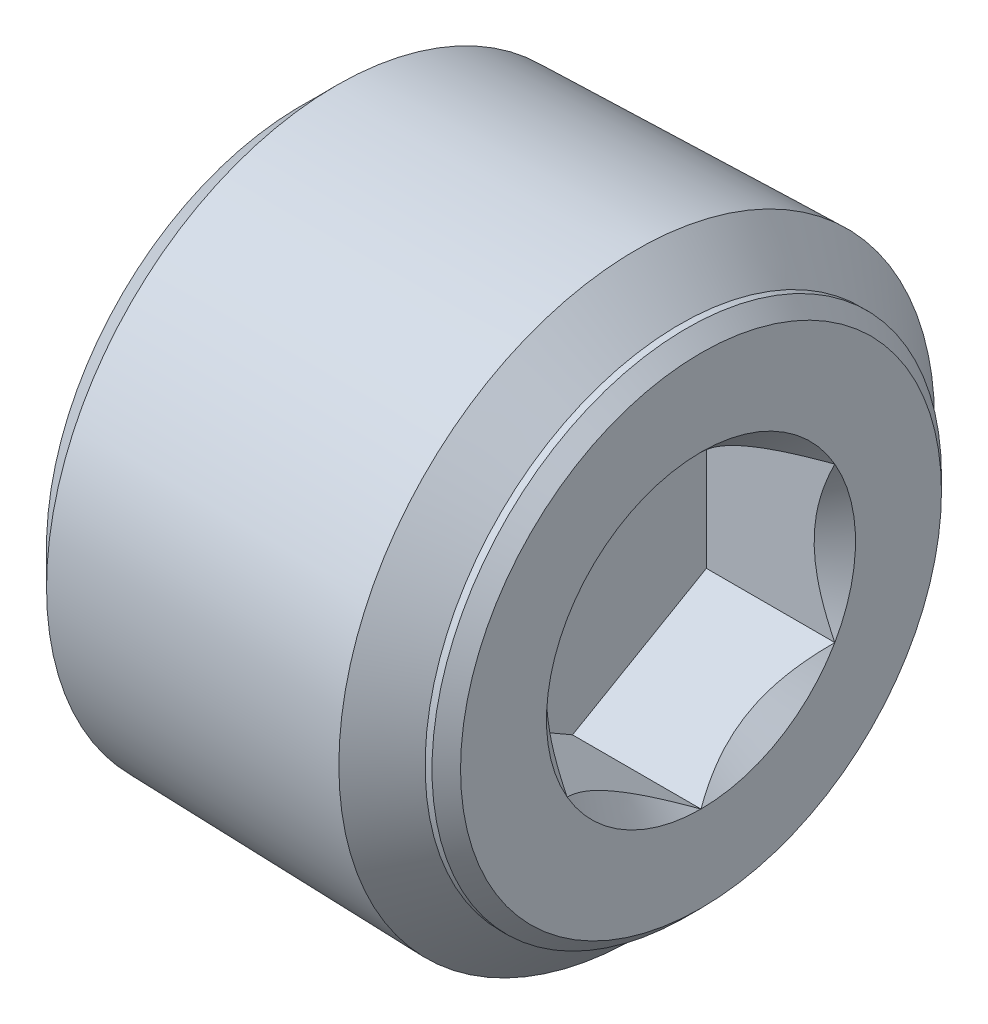
ISO-10303-21;
HEADER;
FILE_DESCRIPTION(('STEP AP214'),'2;1');
FILE_NAME('part.step','',(''),(''),'','','');
FILE_SCHEMA(('AUTOMOTIVE_DESIGN { 1 0 10303 214 1 1 1 1 }'));
ENDSEC;
DATA;
#1=APPLICATION_CONTEXT('core data for automotive mechanical design processes');
#2=APPLICATION_PROTOCOL_DEFINITION('international standard','automotive_design',2000,#1);
#3=PRODUCT_CONTEXT('',#1,'mechanical');
#4=PRODUCT('Part','Part','',(#3));
#5=PRODUCT_RELATED_PRODUCT_CATEGORY('part','',(#4));
#6=PRODUCT_DEFINITION_FORMATION('','',#4);
#7=PRODUCT_DEFINITION_CONTEXT('part definition',#1,'design');
#8=PRODUCT_DEFINITION('design','',#6,#7);
#9=PRODUCT_DEFINITION_SHAPE('','',#8);
#10=(LENGTH_UNIT() NAMED_UNIT(*) SI_UNIT(.MILLI.,.METRE.));
#11=(NAMED_UNIT(*) PLANE_ANGLE_UNIT() SI_UNIT($,.RADIAN.));
#12=(NAMED_UNIT(*) SI_UNIT($,.STERADIAN.) SOLID_ANGLE_UNIT());
#13=UNCERTAINTY_MEASURE_WITH_UNIT(LENGTH_MEASURE(1.E-05),#10,'distance_accuracy_value','');
#14=(GEOMETRIC_REPRESENTATION_CONTEXT(3) GLOBAL_UNCERTAINTY_ASSIGNED_CONTEXT((#13)) GLOBAL_UNIT_ASSIGNED_CONTEXT((#10,
#11,#12)) REPRESENTATION_CONTEXT('',''));
#15=CARTESIAN_POINT('',(0.,0.,0.));
#16=DIRECTION('',(0.,0.,1.));
#17=DIRECTION('',(1.,0.,0.));
#18=AXIS2_PLACEMENT_3D('',#15,#16,#17);
#19=CARTESIAN_POINT('',(-3.556,0.,0.));
#20=DIRECTION('',(1.,0.,0.));
#21=DIRECTION('',(0.,0.,-1.));
#22=AXIS2_PLACEMENT_3D('',#19,#20,#21);
#23=CONICAL_SURFACE('',#22,5.1435,0.026179938779915);
#24=CARTESIAN_POINT('',(-2.92854035608423,0.,0.));
#25=DIRECTION('',(1.,0.,0.));
#26=DIRECTION('',(0.,0.,-1.));
#27=AXIS2_PLACEMENT_3D('',#24,#25,#26);
#28=CIRCLE('',#27,5.15993060902341);
#29=CARTESIAN_POINT('',(-2.92854035608423,0.,-5.15993060902341));
#30=VERTEX_POINT('',#29);
#31=EDGE_CURVE('E360',#30,#30,#28,.T.);
#32=ORIENTED_EDGE('',*,*,#31,.T.);
#33=EDGE_LOOP('',(#32));
#34=FACE_BOUND('',#33,.T.);
#35=CARTESIAN_POINT('',(2.41238695608476,0.,0.));
#36=DIRECTION('',(-1.,0.,0.));
#37=DIRECTION('',(0.,0.,1.));
#38=AXIS2_PLACEMENT_3D('',#35,#36,#37);
#39=CIRCLE('',#38,5.2997877127266);
#40=CARTESIAN_POINT('',(2.41238695608476,0.,5.2997877127266));
#41=VERTEX_POINT('',#40);
#42=EDGE_CURVE('E366',#41,#41,#39,.F.);
#43=ORIENTED_EDGE('',*,*,#42,.F.);
#44=EDGE_LOOP('',(#43));
#45=FACE_BOUND('',#44,.T.);
#46=ADVANCED_FACE('F37',(#34,#45),#23,.T.);
#47=CARTESIAN_POINT('',(-3.556,0.,0.));
#48=DIRECTION('',(1.,0.,0.));
#49=DIRECTION('',(0.,0.,-1.));
#50=AXIS2_PLACEMENT_3D('',#47,#48,#49);
#51=CONICAL_SURFACE('',#50,4.53247096510764,0.78539816339745);
#52=CARTESIAN_POINT('',(-3.556,0.,0.));
#53=DIRECTION('',(1.,0.,0.));
#54=DIRECTION('',(0.,0.,-1.));
#55=AXIS2_PLACEMENT_3D('',#52,#53,#54);
#56=CIRCLE('',#55,4.53247096510764);
#57=CARTESIAN_POINT('',(-3.556,0.,-4.53247096510764));
#58=VERTEX_POINT('',#57);
#59=EDGE_CURVE('E361',#58,#58,#56,.T.);
#60=ORIENTED_EDGE('',*,*,#59,.T.);
#61=EDGE_LOOP('',(#60));
#62=FACE_BOUND('',#61,.T.);
#63=ORIENTED_EDGE('',*,*,#31,.F.);
#64=EDGE_LOOP('',(#63));
#65=FACE_BOUND('',#64,.T.);
#66=ADVANCED_FACE('F201',(#62,#65),#51,.T.);
#67=CARTESIAN_POINT('',(-3.556,0.,0.));
#68=DIRECTION('',(1.,0.,0.));
#69=DIRECTION('',(0.,0.,-1.));
#70=AXIS2_PLACEMENT_3D('',#67,#68,#69);
#71=PLANE('',#70);
#72=ORIENTED_EDGE('',*,*,#59,.F.);
#73=EDGE_LOOP('',(#72));
#74=FACE_BOUND('',#73,.T.);
#75=ADVANCED_FACE('F206',(#74),#71,.F.);
#76=CARTESIAN_POINT('',(3.1797037037037,0.,0.));
#77=DIRECTION('',(-1.,0.,0.));
#78=DIRECTION('',(0.,0.,-1.));
#79=AXIS2_PLACEMENT_3D('',#76,#77,#78);
#80=CONICAL_SURFACE('',#79,4.53247096510764,0.78539816339745);
#81=CARTESIAN_POINT('',(3.1797037037037,0.,0.));
#82=DIRECTION('',(1.,0.,0.));
#83=DIRECTION('',(0.,0.,-1.));
#84=AXIS2_PLACEMENT_3D('',#81,#82,#83);
#85=CIRCLE('',#84,4.53247096510764);
#86=CARTESIAN_POINT('',(3.1797037037037,0.,-4.53247096510764));
#87=VERTEX_POINT('',#86);
#88=EDGE_CURVE('E369',#87,#87,#85,.T.);
#89=ORIENTED_EDGE('',*,*,#88,.F.);
#90=EDGE_LOOP('',(#89));
#91=FACE_BOUND('',#90,.T.);
#92=ORIENTED_EDGE('',*,*,#42,.T.);
#93=EDGE_LOOP('',(#92));
#94=FACE_BOUND('',#93,.T.);
#95=ADVANCED_FACE('F214',(#91,#94),#80,.T.);
#96=CARTESIAN_POINT('',(3.556,0.,0.));
#97=DIRECTION('',(1.,0.,0.));
#98=DIRECTION('',(0.,0.,-1.));
#99=AXIS2_PLACEMENT_3D('',#96,#97,#98);
#100=PLANE('',#99);
#101=CARTESIAN_POINT('',(3.556,0.,0.));
#102=DIRECTION('',(1.,0.,0.));
#103=DIRECTION('',(0.,0.,-1.));
#104=AXIS2_PLACEMENT_3D('',#101,#102,#103);
#105=CIRCLE('',#104,2.74963065701559);
#106=CARTESIAN_POINT('',(3.556,1.37481532850779,-2.38125));
#107=VERTEX_POINT('',#106);
#108=CARTESIAN_POINT('',(3.556,2.74963065701559,0.));
#109=VERTEX_POINT('',#108);
#110=EDGE_CURVE('E91',#107,#109,#105,.T.);
#111=ORIENTED_EDGE('',*,*,#110,.F.);
#112=CARTESIAN_POINT('',(3.556,-1.3748153285078,-2.38125));
#113=VERTEX_POINT('',#112);
#114=EDGE_CURVE('E51',#113,#107,#105,.T.);
#115=ORIENTED_EDGE('',*,*,#114,.F.);
#116=CARTESIAN_POINT('',(3.556,-2.74963065701559,0.));
#117=VERTEX_POINT('',#116);
#118=EDGE_CURVE('E398',#117,#113,#105,.T.);
#119=ORIENTED_EDGE('',*,*,#118,.F.);
#120=CARTESIAN_POINT('',(3.556,-1.3748153285078,2.38125));
#121=VERTEX_POINT('',#120);
#122=EDGE_CURVE('E58',#121,#117,#105,.T.);
#123=ORIENTED_EDGE('',*,*,#122,.F.);
#124=CARTESIAN_POINT('',(3.556,1.3748153285078,2.38125));
#125=VERTEX_POINT('',#124);
#126=EDGE_CURVE('E131',#125,#121,#105,.T.);
#127=ORIENTED_EDGE('',*,*,#126,.F.);
#128=EDGE_CURVE('E100',#109,#125,#105,.T.);
#129=ORIENTED_EDGE('',*,*,#128,.F.);
#130=EDGE_LOOP('',(#111,#115,#119,#123,#127,#129));
#131=FACE_BOUND('',#130,.T.);
#132=CARTESIAN_POINT('',(3.556,0.,0.));
#133=DIRECTION('',(1.,0.,0.));
#134=DIRECTION('',(0.,0.,-1.));
#135=AXIS2_PLACEMENT_3D('',#132,#133,#134);
#136=CIRCLE('',#135,4.27847096510764);
#137=CARTESIAN_POINT('',(3.556,0.,-4.27847096510764));
#138=VERTEX_POINT('',#137);
#139=EDGE_CURVE('E45',#138,#138,#136,.T.);
#140=ORIENTED_EDGE('',*,*,#139,.T.);
#141=EDGE_LOOP('',(#140));
#142=FACE_BOUND('',#141,.T.);
#143=ADVANCED_FACE('F129',(#131,#142),#100,.T.);
#144=CARTESIAN_POINT('',(3.1797037037037,0.,0.));
#145=DIRECTION('',(1.,0.,0.));
#146=DIRECTION('',(0.,0.,-1.));
#147=AXIS2_PLACEMENT_3D('',#144,#145,#146);
#148=CYLINDRICAL_SURFACE('',#147,4.53247096510764);
#149=CARTESIAN_POINT('',(3.302,0.,0.));
#150=DIRECTION('',(1.,0.,0.));
#151=DIRECTION('',(0.,0.,-1.));
#152=AXIS2_PLACEMENT_3D('',#149,#150,#151);
#153=CIRCLE('',#152,4.53247096510764);
#154=CARTESIAN_POINT('',(3.302,0.,-4.53247096510764));
#155=VERTEX_POINT('',#154);
#156=EDGE_CURVE('E12',#155,#155,#153,.F.);
#157=ORIENTED_EDGE('',*,*,#156,.T.);
#158=EDGE_LOOP('',(#157));
#159=FACE_BOUND('',#158,.T.);
#160=ORIENTED_EDGE('',*,*,#88,.T.);
#161=EDGE_LOOP('',(#160));
#162=FACE_BOUND('',#161,.T.);
#163=ADVANCED_FACE('F217',(#159,#162),#148,.T.);
#164=CARTESIAN_POINT('',(3.556,0.,0.));
#165=DIRECTION('',(-1.,0.,0.));
#166=DIRECTION('',(0.,0.,1.));
#167=AXIS2_PLACEMENT_3D('',#164,#165,#166);
#168=CONICAL_SURFACE('',#167,4.27847096510764,0.785398163397448);
#169=ORIENTED_EDGE('',*,*,#156,.F.);
#170=EDGE_LOOP('',(#169));
#171=FACE_BOUND('',#170,.T.);
#172=ORIENTED_EDGE('',*,*,#139,.F.);
#173=EDGE_LOOP('',(#172));
#174=FACE_BOUND('',#173,.T.);
#175=ADVANCED_FACE('F39',(#171,#174),#168,.T.);
#176=CARTESIAN_POINT('',(3.556,0.,0.));
#177=DIRECTION('',(1.,0.,0.));
#178=DIRECTION('',(0.,0.,-1.));
#179=AXIS2_PLACEMENT_3D('',#176,#177,#178);
#180=CONICAL_SURFACE('',#179,2.74963065701559,0.78539816339745);
#181=ORIENTED_EDGE('',*,*,#128,.T.);
#182=CARTESIAN_POINT('',(3.55611547732724,2.74974612706943,-0.000199999999999625));
#183=CARTESIAN_POINT('',(3.50889489670954,2.70248609172789,0.0816567823790504));
#184=CARTESIAN_POINT('',(3.4644475752929,2.65443579722785,0.16488233377176));
#185=CARTESIAN_POINT('',(3.38306545698558,2.556455907536,0.33458848083804));
#186=CARTESIAN_POINT('',(3.34617594309514,2.50651699342501,0.421085217353102));
#187=CARTESIAN_POINT('',(3.28298341316591,2.40581754748857,0.595501774009041));
#188=CARTESIAN_POINT('',(3.25652155872948,2.35508266327639,0.683377171180673));
#189=CARTESIAN_POINT('',(3.21575151561606,2.25249593653966,0.861062594070874));
#190=CARTESIAN_POINT('',(3.20141289153055,2.20064722822085,0.950867191185869));
#191=CARTESIAN_POINT('',(3.18847578477012,2.11128933452158,1.10563960313034));
#192=CARTESIAN_POINT('',(3.18656060465318,2.07389560129144,1.17040744896962));
#193=CARTESIAN_POINT('',(3.18978662276768,1.99916925388849,1.29983727933557));
#194=CARTESIAN_POINT('',(3.19493029485709,1.96183666573622,1.36449921879335));
#195=CARTESIAN_POINT('',(3.21198131087164,1.88752399013711,1.49321254857739));
#196=CARTESIAN_POINT('',(3.22389622134933,1.85054434417201,1.55726317423485));
#197=CARTESIAN_POINT('',(3.25383567235203,1.77722451768917,1.68425683890527));
#198=CARTESIAN_POINT('',(3.27185974451845,1.74088428837517,1.74719996243582));
#199=CARTESIAN_POINT('',(3.32536880755241,1.64780030516185,1.90842615073218));
#200=CARTESIAN_POINT('',(3.36488742087218,1.59163374230437,2.00570949128784));
#201=CARTESIAN_POINT('',(3.4316003435508,1.50904576583588,2.14875606262557));
#202=CARTESIAN_POINT('',(3.45504020911133,1.4818293434813,2.19589628894396));
#203=CARTESIAN_POINT('',(3.50405667665954,1.42790064981105,2.28930352636664));
#204=CARTESIAN_POINT('',(3.52963196676686,1.40118808114506,2.33557105249682));
#205=CARTESIAN_POINT('',(3.55611547732724,1.37469985845396,2.38145));
#206=B_SPLINE_CURVE_WITH_KNOTS('',3,(#182,#183,#184,#185,#186,#187,#188,#189,#190,#191,#192,
#193,#194,#195,#196,#197,#198,#199,#200,#201,#202,#203,#204,#205),.UNSPECIFIED.,.F.,.F.,(4,2,2,
2,2,2,2,2,2,2,2,4),(0.,0.317196610611948,0.636241461041217,0.950218950629219,1.26340583824126,
1.48752413747844,1.71172100167747,1.93616888974081,2.16059957440836,2.51709639744763,
2.69486147369099,2.87251813383154),.UNSPECIFIED.);
#207=EDGE_CURVE('E99',#109,#125,#206,.T.);
#208=ORIENTED_EDGE('',*,*,#207,.F.);
#209=EDGE_LOOP('',(#181,#208));
#210=FACE_BOUND('',#209,.T.);
#211=ADVANCED_FACE('F105',(#210),#180,.F.);
#212=ORIENTED_EDGE('',*,*,#126,.T.);
#213=CARTESIAN_POINT('',(4.47271541112649,-2.78778441219563,2.38125));
#214=CARTESIAN_POINT('',(4.42126754971886,-2.72010759216642,2.38125));
#215=CARTESIAN_POINT('',(4.37030342909743,-2.65205702767121,2.38125));
#216=CARTESIAN_POINT('',(4.26956087821853,-2.51505902131785,2.38125));
#217=CARTESIAN_POINT('',(4.21978274233974,-2.44611136322079,2.38125));
#218=CARTESIAN_POINT('',(4.12127616598597,-2.30666538697512,2.38125));
#219=CARTESIAN_POINT('',(4.07255883072452,-2.23615919760946,2.38125));
#220=CARTESIAN_POINT('',(3.97689665657255,-2.09395822931675,2.38125));
#221=CARTESIAN_POINT('',(3.92995169369347,-2.02226353403998,2.38125));
#222=CARTESIAN_POINT('',(3.83550082426837,-1.87318157487134,2.38125));
#223=CARTESIAN_POINT('',(3.78812799969588,-1.79570956798511,2.38125));
#224=CARTESIAN_POINT('',(3.69644738214397,-1.63897526960824,2.38125));
#225=CARTESIAN_POINT('',(3.65213918658097,-1.55971321508796,2.38125));
#226=CARTESIAN_POINT('',(3.5675177629337,-1.39936201208901,2.38125));
#227=CARTESIAN_POINT('',(3.52719333714926,-1.31827881955674,2.38125));
#228=CARTESIAN_POINT('',(3.45144985771474,-1.15387104478002,2.38125));
#229=CARTESIAN_POINT('',(3.41602854857673,-1.07054751432376,2.38125));
#230=CARTESIAN_POINT('',(3.35418387969588,-0.90889089954783,2.38125));
#231=CARTESIAN_POINT('',(3.3272449811477,-0.830757093392354,2.38125));
#232=CARTESIAN_POINT('',(3.279629606023,-0.672568271802735,2.38125));
#233=CARTESIAN_POINT('',(3.2589535483539,-0.592513128240977,2.38125));
#234=CARTESIAN_POINT('',(3.22530169560673,-0.432313535258421,2.38125));
#235=CARTESIAN_POINT('',(3.21219112751661,-0.352197871157622,2.38125));
#236=CARTESIAN_POINT('',(3.19393204032071,-0.191059474930294,2.38125));
#237=CARTESIAN_POINT('',(3.18878205458479,-0.110036912658787,2.38125));
#238=CARTESIAN_POINT('',(3.18684721288921,0.0489619568367768,2.38125));
#239=CARTESIAN_POINT('',(3.18974556433605,0.126934492876664,2.38125));
#240=CARTESIAN_POINT('',(3.20303752714723,0.282233283697431,2.38125));
#241=CARTESIAN_POINT('',(3.21343185051391,0.359559476379757,2.38125));
#242=CARTESIAN_POINT('',(3.24131715305985,0.514316775735605,2.38125));
#243=CARTESIAN_POINT('',(3.25893052155444,0.591725500190306,2.38125));
#244=CARTESIAN_POINT('',(3.30030391638431,0.744842484650164,2.38125));
#245=CARTESIAN_POINT('',(3.32406348691027,0.82055087030206,2.38125));
#246=CARTESIAN_POINT('',(3.40721811924092,1.05687746293571,2.38125));
#247=CARTESIAN_POINT('',(3.47599823645053,1.21420525817212,2.38125));
#248=CARTESIAN_POINT('',(3.5906725469918,1.4444429103218,2.38125));
#249=CARTESIAN_POINT('',(3.63090460604891,1.52037247424081,2.38125));
#250=CARTESIAN_POINT('',(3.71447132596669,1.67050883715942,2.38125));
#251=CARTESIAN_POINT('',(3.75780543303833,1.74471594054207,2.38125));
#252=CARTESIAN_POINT('',(3.84474016068554,1.88796752692232,2.38125));
#253=CARTESIAN_POINT('',(3.88822099819505,1.95708553613458,2.38125));
#254=CARTESIAN_POINT('',(3.97702142273679,2.09413609519946,2.38125));
#255=CARTESIAN_POINT('',(4.02234114851942,2.1620685550432,2.38125));
#256=CARTESIAN_POINT('',(4.11411756879495,2.29635234061959,2.38125));
#257=CARTESIAN_POINT('',(4.1605621059153,2.36271200992475,2.38125));
#258=CARTESIAN_POINT('',(4.25468628731882,2.49452301460492,2.38125));
#259=CARTESIAN_POINT('',(4.3023655880396,2.55997459502686,2.38125));
#260=CARTESIAN_POINT('',(4.35055009427172,2.62504583489422,2.38125));
#261=B_SPLINE_CURVE_WITH_KNOTS('',3,(#213,#214,#215,#216,#217,#218,#219,#220,#221,#222,#223,
#224,#225,#226,#227,#228,#229,#230,#231,#232,#233,#234,#235,#236,#237,#238,#239,#240,#241,#242,
#243,#244,#245,#246,#247,#248,#249,#250,#251,#252,#253,#254,#255,#256,#257,#258,#259,#260),
.UNSPECIFIED.,.F.,.F.,(4,2,2,2,2,2,2,2,2,2,2,2,2,2,2,2,2,2,2,2,2,2,2,4),(0.,0.255040809094692,
0.510144277062726,0.76722203318704,1.02428177166123,1.2966499195995,1.56898221979864,
1.84052585446871,2.11194415796923,2.35967016199274,2.60741273219744,2.85059368779453,
3.09372983523197,3.3274329547983,3.56115827550052,3.79902174822543,4.03686758578061,
4.55038530526843,4.80815341388469,5.06587561900448,5.31081733436981,5.55577756591949,
5.79875695917182,6.04166945685491),.UNSPECIFIED.);
#262=EDGE_CURVE('E109',#125,#121,#261,.F.);
#263=ORIENTED_EDGE('',*,*,#262,.F.);
#264=EDGE_LOOP('',(#212,#263));
#265=FACE_BOUND('',#264,.T.);
#266=ADVANCED_FACE('F291',(#265),#180,.F.);
#267=ORIENTED_EDGE('',*,*,#122,.T.);
#268=CARTESIAN_POINT('',(3.55611547732724,-1.37469985845396,2.38145));
#269=CARTESIAN_POINT('',(3.50889489670954,-1.4219598937955,2.29959321762095));
#270=CARTESIAN_POINT('',(3.4644475752929,-1.47001018829554,2.21636766622824));
#271=CARTESIAN_POINT('',(3.38306545698558,-1.56799007798739,2.04666151916196));
#272=CARTESIAN_POINT('',(3.34617594309514,-1.61792899209838,1.9601647826469));
#273=CARTESIAN_POINT('',(3.28298341316591,-1.71862843803482,1.78574822599096));
#274=CARTESIAN_POINT('',(3.25652155872948,-1.769363322247,1.69787282881933));
#275=CARTESIAN_POINT('',(3.21575151561606,-1.87195004898373,1.52018740592913));
#276=CARTESIAN_POINT('',(3.20141289153055,-1.92379875730254,1.43038280881413));
#277=CARTESIAN_POINT('',(3.18847578477012,-2.01315665100181,1.27561039686966));
#278=CARTESIAN_POINT('',(3.18656060465318,-2.05055038423195,1.21084255103038));
#279=CARTESIAN_POINT('',(3.18978662276768,-2.1252767316349,1.08141272066443));
#280=CARTESIAN_POINT('',(3.19493029485709,-2.16260931978717,1.01675078120665));
#281=CARTESIAN_POINT('',(3.21198131087164,-2.23692199538628,0.888037451422605));
#282=CARTESIAN_POINT('',(3.22389622134933,-2.27390164135138,0.823986825765148));
#283=CARTESIAN_POINT('',(3.25383567235203,-2.34722146783422,0.696993161094729));
#284=CARTESIAN_POINT('',(3.27185974451845,-2.38356169714822,0.634050037564178));
#285=CARTESIAN_POINT('',(3.32536880755241,-2.47664568036154,0.47282384926782));
#286=CARTESIAN_POINT('',(3.36488742087218,-2.53281224321902,0.375540508712161));
#287=CARTESIAN_POINT('',(3.4316003435508,-2.61540021968751,0.232493937374431));
#288=CARTESIAN_POINT('',(3.45504020911134,-2.64261664204209,0.185353711056036));
#289=CARTESIAN_POINT('',(3.50405667665954,-2.69654533571233,0.0919464736333625));
#290=CARTESIAN_POINT('',(3.52963196676686,-2.72325790437833,0.0456789475031791));
#291=CARTESIAN_POINT('',(3.55611547732724,-2.74974612706943,-0.000199999999999681));
#292=B_SPLINE_CURVE_WITH_KNOTS('',3,(#268,#269,#270,#271,#272,#273,#274,#275,#276,#277,#278,
#279,#280,#281,#282,#283,#284,#285,#286,#287,#288,#289,#290,#291),.UNSPECIFIED.,.F.,.F.,(4,2,2,
2,2,2,2,2,2,2,2,4),(0.,0.317196610611948,0.636241461041218,0.950218950629221,1.26340583824126,
1.48752413747844,1.71172100167747,1.93616888974082,2.16059957440836,2.51709639744763,
2.69486147369099,2.87251813383154),.UNSPECIFIED.);
#293=EDGE_CURVE('E158',#121,#117,#292,.T.);
#294=ORIENTED_EDGE('',*,*,#293,.F.);
#295=EDGE_LOOP('',(#267,#294));
#296=FACE_BOUND('',#295,.T.);
#297=ADVANCED_FACE('F282',(#296),#180,.F.);
#298=ORIENTED_EDGE('',*,*,#118,.T.);
#299=CARTESIAN_POINT('',(3.55611547732724,-2.74974612706943,0.000200000000000406));
#300=CARTESIAN_POINT('',(3.50889489670954,-2.70248609172789,-0.0816567823790498));
#301=CARTESIAN_POINT('',(3.4644475752929,-2.65443579722785,-0.16488233377176));
#302=CARTESIAN_POINT('',(3.38306545698558,-2.556455907536,-0.334588480838039));
#303=CARTESIAN_POINT('',(3.34617594309514,-2.50651699342501,-0.421085217353102));
#304=CARTESIAN_POINT('',(3.28298341316591,-2.40581754748857,-0.595501774009041));
#305=CARTESIAN_POINT('',(3.25652155872948,-2.35508266327639,-0.683377171180674));
#306=CARTESIAN_POINT('',(3.21575151561606,-2.25249593653966,-0.861062594070874));
#307=CARTESIAN_POINT('',(3.20141289153055,-2.20064722822085,-0.950867191185869));
#308=CARTESIAN_POINT('',(3.18847578477012,-2.11128933452158,-1.10563960313034));
#309=CARTESIAN_POINT('',(3.18656060465318,-2.07389560129144,-1.17040744896962));
#310=CARTESIAN_POINT('',(3.18978662276768,-1.99916925388849,-1.29983727933557));
#311=CARTESIAN_POINT('',(3.19493029485709,-1.96183666573622,-1.36449921879335));
#312=CARTESIAN_POINT('',(3.21198131087164,-1.88752399013711,-1.49321254857739));
#313=CARTESIAN_POINT('',(3.22389622134933,-1.85054434417201,-1.55726317423485));
#314=CARTESIAN_POINT('',(3.25383567235203,-1.77722451768917,-1.68425683890527));
#315=CARTESIAN_POINT('',(3.27185974451845,-1.74088428837517,-1.74719996243582));
#316=CARTESIAN_POINT('',(3.32536880755241,-1.64780030516185,-1.90842615073218));
#317=CARTESIAN_POINT('',(3.36488742087218,-1.59163374230437,-2.00570949128784));
#318=CARTESIAN_POINT('',(3.4316003435508,-1.50904576583588,-2.14875606262557));
#319=CARTESIAN_POINT('',(3.45504020911134,-1.4818293434813,-2.19589628894396));
#320=CARTESIAN_POINT('',(3.50405667665954,-1.42790064981106,-2.28930352636664));
#321=CARTESIAN_POINT('',(3.52963196676686,-1.40118808114506,-2.33557105249682));
#322=CARTESIAN_POINT('',(3.55611547732724,-1.37469985845396,-2.38145));
#323=B_SPLINE_CURVE_WITH_KNOTS('',3,(#299,#300,#301,#302,#303,#304,#305,#306,#307,#308,#309,
#310,#311,#312,#313,#314,#315,#316,#317,#318,#319,#320,#321,#322),.UNSPECIFIED.,.F.,.F.,(4,2,2,
2,2,2,2,2,2,2,2,4),(0.,0.317196610611949,0.636241461041218,0.950218950629221,1.26340583824126,
1.48752413747844,1.71172100167747,1.93616888974082,2.16059957440836,2.51709639744763,
2.69486147369099,2.87251813383154),.UNSPECIFIED.);
#324=EDGE_CURVE('E165',#117,#113,#323,.T.);
#325=ORIENTED_EDGE('',*,*,#324,.F.);
#326=EDGE_LOOP('',(#298,#325));
#327=FACE_BOUND('',#326,.T.);
#328=ADVANCED_FACE('F274',(#327),#180,.F.);
#329=ORIENTED_EDGE('',*,*,#114,.T.);
#330=CARTESIAN_POINT('',(4.47271541120113,-2.78778441229379,-2.38125));
#331=CARTESIAN_POINT('',(4.42126754979062,-2.72010759226179,-2.38125));
#332=CARTESIAN_POINT('',(4.37030342916631,-2.65205702776379,-2.38125));
#333=CARTESIAN_POINT('',(4.26956087828168,-2.51505902140481,-2.38125));
#334=CARTESIAN_POINT('',(4.21978274240002,-2.44611136330494,-2.38125));
#335=CARTESIAN_POINT('',(4.12127616604052,-2.30666538705353,-2.38125));
#336=CARTESIAN_POINT('',(4.07255883077619,-2.23615919768495,-2.38125));
#337=CARTESIAN_POINT('',(3.97689665661851,-2.09395822938637,-2.38125));
#338=CARTESIAN_POINT('',(3.92995169373659,-2.02226353410663,-2.38125));
#339=CARTESIAN_POINT('',(3.83550082430559,-1.87318157493159,-2.38125));
#340=CARTESIAN_POINT('',(3.78812799973004,-1.79570956804191,-2.38125));
#341=CARTESIAN_POINT('',(3.69644738217216,-1.63897526965803,-2.38125));
#342=CARTESIAN_POINT('',(3.65213918660625,-1.55971321513419,-2.38125));
#343=CARTESIAN_POINT('',(3.56751776295339,-1.39936201212798,-2.38125));
#344=CARTESIAN_POINT('',(3.52719333716627,-1.31827881959202,-2.38125));
#345=CARTESIAN_POINT('',(3.45144985772674,-1.15387104480771,-2.38125));
#346=CARTESIAN_POINT('',(3.41602854858639,-1.07054751434756,-2.38125));
#347=CARTESIAN_POINT('',(3.35418387970384,-0.908890899569974,-2.38125));
#348=CARTESIAN_POINT('',(3.32724498115587,-0.830757093416901,-2.38125));
#349=CARTESIAN_POINT('',(3.27962960603108,-0.672568271832171,-2.38125));
#350=CARTESIAN_POINT('',(3.2589535483617,-0.5925131282729,-2.38125));
#351=CARTESIAN_POINT('',(3.2253016956134,-0.432313535295238,-2.38125));
#352=CARTESIAN_POINT('',(3.21219112752244,-0.352197871196845,-2.38125));
#353=CARTESIAN_POINT('',(3.19393204032431,-0.191059474974255,-2.38125));
#354=CARTESIAN_POINT('',(3.18878205458701,-0.110036912705079,-2.38125));
#355=CARTESIAN_POINT('',(3.18684721288824,0.0489619567863076,-2.38125));
#356=CARTESIAN_POINT('',(3.18974556433332,0.126934492824343,-2.38125));
#357=CARTESIAN_POINT('',(3.2030375271407,0.282233283641599,-2.38125));
#358=CARTESIAN_POINT('',(3.21343185050536,0.359559476322267,-2.38125));
#359=CARTESIAN_POINT('',(3.24131715304706,0.514316775674839,-2.38125));
#360=CARTESIAN_POINT('',(3.25893052153942,0.59172550012793,-2.38125));
#361=CARTESIAN_POINT('',(3.30030391636479,0.744842484584727,-2.38125));
#362=CARTESIAN_POINT('',(3.32406348688849,0.820550870235173,-2.38125));
#363=CARTESIAN_POINT('',(3.40721811920851,1.0568774628544,-2.38125));
#364=CARTESIAN_POINT('',(3.47599823640836,1.21420525807854,-2.38125));
#365=CARTESIAN_POINT('',(3.59067254693419,1.44444291021056,-2.38125));
#366=CARTESIAN_POINT('',(3.630904605986,1.52037247412379,-2.38125));
#367=CARTESIAN_POINT('',(3.714471325893,1.67050883703103,-2.38125));
#368=CARTESIAN_POINT('',(3.75780543295918,1.74471594040809,-2.38125));
#369=CARTESIAN_POINT('',(3.84474016059601,1.88796752677817,-2.38125));
#370=CARTESIAN_POINT('',(3.88822099810063,1.95708553598584,-2.38125));
#371=CARTESIAN_POINT('',(3.97702142263256,2.09413609504161,-2.38125));
#372=CARTESIAN_POINT('',(4.02234114841028,2.16206855488083,-2.38125));
#373=CARTESIAN_POINT('',(4.11411756867605,2.29635234044828,-2.38125));
#374=CARTESIAN_POINT('',(4.16056210579154,2.36271200974903,-2.38125));
#375=CARTESIAN_POINT('',(4.25468628718536,2.49452301442041,-2.38125));
#376=CARTESIAN_POINT('',(4.30236558790129,2.55997459483796,-2.38125));
#377=CARTESIAN_POINT('',(4.35055009412857,2.62504583470095,-2.38125));
#378=B_SPLINE_CURVE_WITH_KNOTS('',3,(#330,#331,#332,#333,#334,#335,#336,#337,#338,#339,#340,
#341,#342,#343,#344,#345,#346,#347,#348,#349,#350,#351,#352,#353,#354,#355,#356,#357,#358,#359,
#360,#361,#362,#363,#364,#365,#366,#367,#368,#369,#370,#371,#372,#373,#374,#375,#376,#377),
.UNSPECIFIED.,.F.,.F.,(4,2,2,2,2,2,2,2,2,2,2,2,2,2,2,2,2,2,2,2,2,2,2,4),(0.,0.255040809106571,
0.510144277086485,0.767222033222905,1.0242817717092,1.29664991966106,1.56898221987379,
1.84052585455735,2.11194415807133,2.35967016208786,2.60741273228559,2.85059368787599,
3.09372983530676,3.32743295486736,3.56115827556386,3.79902174828258,4.03686758583157,
4.55038530527416,4.80815341386764,5.06587561896467,5.31081733431054,5.55577756584076,
5.79875695907389,6.04166945673778),.UNSPECIFIED.);
#379=EDGE_CURVE('E119',#113,#107,#378,.T.);
#380=ORIENTED_EDGE('',*,*,#379,.F.);
#381=EDGE_LOOP('',(#329,#380));
#382=FACE_BOUND('',#381,.T.);
#383=ADVANCED_FACE('F151',(#382),#180,.F.);
#384=ORIENTED_EDGE('',*,*,#110,.T.);
#385=CARTESIAN_POINT('',(3.55611547732724,1.37469985845396,-2.38145));
#386=CARTESIAN_POINT('',(3.50889489670954,1.4219598937955,-2.29959321762095));
#387=CARTESIAN_POINT('',(3.4644475752929,1.47001018829554,-2.21636766622824));
#388=CARTESIAN_POINT('',(3.38306545698558,1.56799007798739,-2.04666151916196));
#389=CARTESIAN_POINT('',(3.34617594309514,1.61792899209838,-1.9601647826469));
#390=CARTESIAN_POINT('',(3.28298341316591,1.71862843803482,-1.78574822599096));
#391=CARTESIAN_POINT('',(3.25652155872948,1.769363322247,-1.69787282881933));
#392=CARTESIAN_POINT('',(3.21575151561606,1.87195004898373,-1.52018740592913));
#393=CARTESIAN_POINT('',(3.20141289153055,1.92379875730254,-1.43038280881413));
#394=CARTESIAN_POINT('',(3.18847578477011,2.01315665100181,-1.27561039686966));
#395=CARTESIAN_POINT('',(3.18656060465318,2.05055038423195,-1.21084255103038));
#396=CARTESIAN_POINT('',(3.18978662276768,2.1252767316349,-1.08141272066443));
#397=CARTESIAN_POINT('',(3.19493029485709,2.16260931978717,-1.01675078120665));
#398=CARTESIAN_POINT('',(3.21198131087164,2.23692199538628,-0.888037451422605));
#399=CARTESIAN_POINT('',(3.22389622134933,2.27390164135138,-0.823986825765148));
#400=CARTESIAN_POINT('',(3.25383567235203,2.34722146783422,-0.696993161094729));
#401=CARTESIAN_POINT('',(3.27185974451845,2.38356169714822,-0.634050037564178));
#402=CARTESIAN_POINT('',(3.32536880755241,2.47664568036154,-0.47282384926782));
#403=CARTESIAN_POINT('',(3.36488742087218,2.53281224321902,-0.375540508712161));
#404=CARTESIAN_POINT('',(3.4316003435508,2.61540021968751,-0.23249393737443));
#405=CARTESIAN_POINT('',(3.45504020911133,2.64261664204209,-0.185353711056036));
#406=CARTESIAN_POINT('',(3.50405667665954,2.69654533571233,-0.0919464736333616));
#407=CARTESIAN_POINT('',(3.52963196676686,2.72325790437833,-0.0456789475031781));
#408=CARTESIAN_POINT('',(3.55611547732724,2.74974612706943,0.000200000000000952));
#409=B_SPLINE_CURVE_WITH_KNOTS('',3,(#385,#386,#387,#388,#389,#390,#391,#392,#393,#394,#395,
#396,#397,#398,#399,#400,#401,#402,#403,#404,#405,#406,#407,#408),.UNSPECIFIED.,.F.,.F.,(4,2,2,
2,2,2,2,2,2,2,2,4),(0.,0.317196610611948,0.636241461041218,0.950218950629221,1.26340583824126,
1.48752413747844,1.71172100167747,1.93616888974082,2.16059957440836,2.51709639744763,
2.69486147369099,2.87251813383154),.UNSPECIFIED.);
#410=EDGE_CURVE('E95',#107,#109,#409,.T.);
#411=ORIENTED_EDGE('',*,*,#410,.F.);
#412=EDGE_LOOP('',(#384,#411));
#413=FACE_BOUND('',#412,.T.);
#414=ADVANCED_FACE('F93',(#413),#180,.F.);
#415=CARTESIAN_POINT('',(1.27,4.12444598552339,2.38125));
#416=DIRECTION('',(1.,0.,0.));
#417=DIRECTION('',(0.,0.,-1.));
#418=AXIS2_PLACEMENT_3D('',#415,#416,#417);
#419=PLANE('',#418);
#420=DIRECTION('',(0.,0.5,0.866025403784439));
#421=VECTOR('',#420,1.);
#422=CARTESIAN_POINT('',(1.27,1.3748153285078,-2.38125));
#423=LINE('',#422,#421);
#424=CARTESIAN_POINT('',(1.27,1.3748153285078,-2.38125));
#425=VERTEX_POINT('',#424);
#426=CARTESIAN_POINT('',(1.27,2.74963065701559,0.));
#427=VERTEX_POINT('',#426);
#428=EDGE_CURVE('E118',#425,#427,#423,.T.);
#429=ORIENTED_EDGE('',*,*,#428,.T.);
#430=DIRECTION('',(0.,-0.5,0.866025403784439));
#431=VECTOR('',#430,1.);
#432=CARTESIAN_POINT('',(1.27,2.74963065701559,0.));
#433=LINE('',#432,#431);
#434=CARTESIAN_POINT('',(1.27,1.3748153285078,2.38125));
#435=VERTEX_POINT('',#434);
#436=EDGE_CURVE('E123',#427,#435,#433,.T.);
#437=ORIENTED_EDGE('',*,*,#436,.T.);
#438=DIRECTION('',(0.,-1.,0.));
#439=VECTOR('',#438,1.);
#440=CARTESIAN_POINT('',(1.27,1.3748153285078,2.38125));
#441=LINE('',#440,#439);
#442=CARTESIAN_POINT('',(1.27,-1.3748153285078,2.38125));
#443=VERTEX_POINT('',#442);
#444=EDGE_CURVE('E390',#435,#443,#441,.T.);
#445=ORIENTED_EDGE('',*,*,#444,.T.);
#446=DIRECTION('',(0.,-0.5,-0.866025403784439));
#447=VECTOR('',#446,1.);
#448=CARTESIAN_POINT('',(1.27,-1.3748153285078,2.38125));
#449=LINE('',#448,#447);
#450=CARTESIAN_POINT('',(1.27,-2.74963065701559,0.));
#451=VERTEX_POINT('',#450);
#452=EDGE_CURVE('E387',#443,#451,#449,.T.);
#453=ORIENTED_EDGE('',*,*,#452,.T.);
#454=DIRECTION('',(0.,0.5,-0.866025403784439));
#455=VECTOR('',#454,1.);
#456=CARTESIAN_POINT('',(1.27,-2.74963065701559,0.));
#457=LINE('',#456,#455);
#458=CARTESIAN_POINT('',(1.27,-1.3748153285078,-2.38125));
#459=VERTEX_POINT('',#458);
#460=EDGE_CURVE('E384',#451,#459,#457,.T.);
#461=ORIENTED_EDGE('',*,*,#460,.T.);
#462=DIRECTION('',(0.,1.,0.));
#463=VECTOR('',#462,1.);
#464=CARTESIAN_POINT('',(1.27,-1.3748153285078,-2.38125));
#465=LINE('',#464,#463);
#466=EDGE_CURVE('E126',#459,#425,#465,.T.);
#467=ORIENTED_EDGE('',*,*,#466,.T.);
#468=EDGE_LOOP('',(#429,#437,#445,#453,#461,#467));
#469=FACE_BOUND('',#468,.T.);
#470=ADVANCED_FACE('F150',(#469),#419,.T.);
#471=CARTESIAN_POINT('',(1.27,2.74963065701559,0.));
#472=DIRECTION('',(0.,0.866025403784439,0.5));
#473=DIRECTION('',(0.,-0.5,0.866025403784439));
#474=AXIS2_PLACEMENT_3D('',#471,#472,#473);
#475=PLANE('',#474);
#476=DIRECTION('',(1.,0.,0.));
#477=VECTOR('',#476,1.);
#478=CARTESIAN_POINT('',(1.27,2.74963065701559,0.));
#479=LINE('',#478,#477);
#480=EDGE_CURVE('E115',#427,#109,#479,.T.);
#481=ORIENTED_EDGE('',*,*,#480,.T.);
#482=ORIENTED_EDGE('',*,*,#207,.T.);
#483=DIRECTION('',(1.,0.,0.));
#484=VECTOR('',#483,1.);
#485=CARTESIAN_POINT('',(1.27,1.3748153285078,2.38125));
#486=LINE('',#485,#484);
#487=EDGE_CURVE('E125',#435,#125,#486,.T.);
#488=ORIENTED_EDGE('',*,*,#487,.F.);
#489=ORIENTED_EDGE('',*,*,#436,.F.);
#490=EDGE_LOOP('',(#481,#482,#488,#489));
#491=FACE_BOUND('',#490,.T.);
#492=ADVANCED_FACE('F121',(#491),#475,.F.);
#493=CARTESIAN_POINT('',(1.27,1.3748153285078,2.38125));
#494=DIRECTION('',(0.,0.,1.));
#495=DIRECTION('',(0.,-1.,0.));
#496=AXIS2_PLACEMENT_3D('',#493,#494,#495);
#497=PLANE('',#496);
#498=ORIENTED_EDGE('',*,*,#487,.T.);
#499=ORIENTED_EDGE('',*,*,#262,.T.);
#500=DIRECTION('',(1.,0.,0.));
#501=VECTOR('',#500,1.);
#502=CARTESIAN_POINT('',(1.27,-1.3748153285078,2.38125));
#503=LINE('',#502,#501);
#504=EDGE_CURVE('E373',#443,#121,#503,.T.);
#505=ORIENTED_EDGE('',*,*,#504,.F.);
#506=ORIENTED_EDGE('',*,*,#444,.F.);
#507=EDGE_LOOP('',(#498,#499,#505,#506));
#508=FACE_BOUND('',#507,.T.);
#509=ADVANCED_FACE('F192',(#508),#497,.F.);
#510=CARTESIAN_POINT('',(1.27,-1.3748153285078,2.38125));
#511=DIRECTION('',(0.,-0.866025403784439,0.5));
#512=DIRECTION('',(0.,-0.5,-0.866025403784439));
#513=AXIS2_PLACEMENT_3D('',#510,#511,#512);
#514=PLANE('',#513);
#515=ORIENTED_EDGE('',*,*,#504,.T.);
#516=ORIENTED_EDGE('',*,*,#293,.T.);
#517=DIRECTION('',(1.,0.,0.));
#518=VECTOR('',#517,1.);
#519=CARTESIAN_POINT('',(1.27,-2.74963065701559,0.));
#520=LINE('',#519,#518);
#521=EDGE_CURVE('E376',#451,#117,#520,.T.);
#522=ORIENTED_EDGE('',*,*,#521,.F.);
#523=ORIENTED_EDGE('',*,*,#452,.F.);
#524=EDGE_LOOP('',(#515,#516,#522,#523));
#525=FACE_BOUND('',#524,.T.);
#526=ADVANCED_FACE('F188',(#525),#514,.F.);
#527=CARTESIAN_POINT('',(1.27,-2.74963065701559,0.));
#528=DIRECTION('',(0.,-0.866025403784439,-0.5));
#529=DIRECTION('',(0.,0.5,-0.866025403784439));
#530=AXIS2_PLACEMENT_3D('',#527,#528,#529);
#531=PLANE('',#530);
#532=ORIENTED_EDGE('',*,*,#521,.T.);
#533=ORIENTED_EDGE('',*,*,#324,.T.);
#534=DIRECTION('',(1.,0.,0.));
#535=VECTOR('',#534,1.);
#536=CARTESIAN_POINT('',(1.27,-1.3748153285078,-2.38125));
#537=LINE('',#536,#535);
#538=EDGE_CURVE('E379',#459,#113,#537,.T.);
#539=ORIENTED_EDGE('',*,*,#538,.F.);
#540=ORIENTED_EDGE('',*,*,#460,.F.);
#541=EDGE_LOOP('',(#532,#533,#539,#540));
#542=FACE_BOUND('',#541,.T.);
#543=ADVANCED_FACE('F184',(#542),#531,.F.);
#544=CARTESIAN_POINT('',(1.27,-1.3748153285078,-2.38125));
#545=DIRECTION('',(0.,0.,-1.));
#546=DIRECTION('',(0.,1.,0.));
#547=AXIS2_PLACEMENT_3D('',#544,#545,#546);
#548=PLANE('',#547);
#549=ORIENTED_EDGE('',*,*,#538,.T.);
#550=ORIENTED_EDGE('',*,*,#379,.T.);
#551=DIRECTION('',(1.,0.,0.));
#552=VECTOR('',#551,1.);
#553=CARTESIAN_POINT('',(1.27,1.3748153285078,-2.38125));
#554=LINE('',#553,#552);
#555=EDGE_CURVE('E117',#425,#107,#554,.T.);
#556=ORIENTED_EDGE('',*,*,#555,.F.);
#557=ORIENTED_EDGE('',*,*,#466,.F.);
#558=EDGE_LOOP('',(#549,#550,#556,#557));
#559=FACE_BOUND('',#558,.T.);
#560=ADVANCED_FACE('F181',(#559),#548,.F.);
#561=CARTESIAN_POINT('',(1.27,1.3748153285078,-2.38125));
#562=DIRECTION('',(0.,0.866025403784439,-0.5));
#563=DIRECTION('',(0.,0.5,0.866025403784439));
#564=AXIS2_PLACEMENT_3D('',#561,#562,#563);
#565=PLANE('',#564);
#566=ORIENTED_EDGE('',*,*,#555,.T.);
#567=ORIENTED_EDGE('',*,*,#410,.T.);
#568=ORIENTED_EDGE('',*,*,#480,.F.);
#569=ORIENTED_EDGE('',*,*,#428,.F.);
#570=EDGE_LOOP('',(#566,#567,#568,#569));
#571=FACE_BOUND('',#570,.T.);
#572=ADVANCED_FACE('F113',(#571),#565,.F.);
#573=CLOSED_SHELL('',(#46,#66,#75,#95,#143,#163,#175,#211,#266,#297,#328,#383,#414,#470,#492,
#509,#526,#543,#560,#572));
#574=MANIFOLD_SOLID_BREP('B2',#573);
#575=ADVANCED_BREP_SHAPE_REPRESENTATION('',(#18,#574),#14);
#576=SHAPE_DEFINITION_REPRESENTATION(#9,#575);
ENDSEC;
END-ISO-10303-21;
